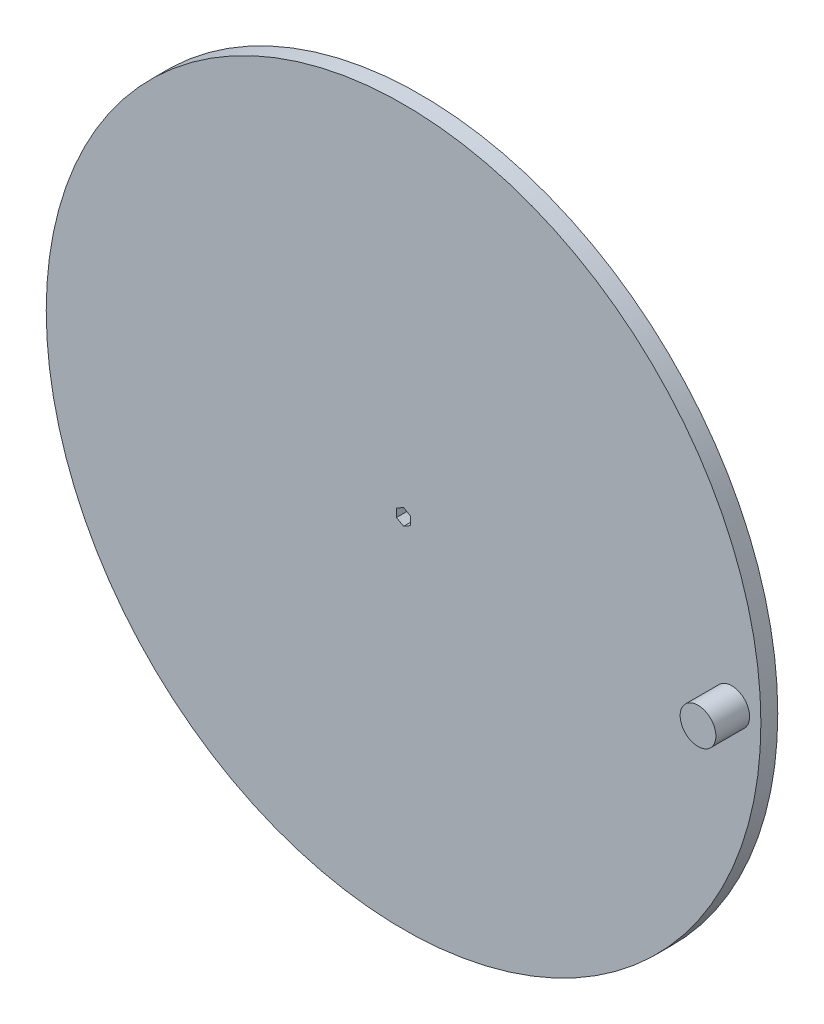
ISO-10303-21;
HEADER;
FILE_DESCRIPTION(('STEP AP214'),'2;1');
FILE_NAME('part.step','',(''),(''),'','','');
FILE_SCHEMA(('AUTOMOTIVE_DESIGN { 1 0 10303 214 1 1 1 1 }'));
ENDSEC;
DATA;
#1=APPLICATION_CONTEXT('core data for automotive mechanical design processes');
#2=APPLICATION_PROTOCOL_DEFINITION('international standard','automotive_design',2000,#1);
#3=PRODUCT_CONTEXT('',#1,'mechanical');
#4=PRODUCT('Part','Part','',(#3));
#5=PRODUCT_RELATED_PRODUCT_CATEGORY('part','',(#4));
#6=PRODUCT_DEFINITION_FORMATION('','',#4);
#7=PRODUCT_DEFINITION_CONTEXT('part definition',#1,'design');
#8=PRODUCT_DEFINITION('design','',#6,#7);
#9=PRODUCT_DEFINITION_SHAPE('','',#8);
#10=(LENGTH_UNIT() NAMED_UNIT(*) SI_UNIT(.MILLI.,.METRE.));
#11=(NAMED_UNIT(*) PLANE_ANGLE_UNIT() SI_UNIT($,.RADIAN.));
#12=(NAMED_UNIT(*) SI_UNIT($,.STERADIAN.) SOLID_ANGLE_UNIT());
#13=UNCERTAINTY_MEASURE_WITH_UNIT(LENGTH_MEASURE(1.E-05),#10,'distance_accuracy_value','');
#14=(GEOMETRIC_REPRESENTATION_CONTEXT(3) GLOBAL_UNCERTAINTY_ASSIGNED_CONTEXT((#13)) GLOBAL_UNIT_ASSIGNED_CONTEXT((#10,
#11,#12)) REPRESENTATION_CONTEXT('',''));
#15=CARTESIAN_POINT('',(0.,0.,0.));
#16=DIRECTION('',(0.,0.,1.));
#17=DIRECTION('',(1.,0.,0.));
#18=AXIS2_PLACEMENT_3D('',#15,#16,#17);
#19=CARTESIAN_POINT('',(0.,0.,0.));
#20=DIRECTION('',(0.,0.,1.));
#21=DIRECTION('',(1.,0.,0.));
#22=AXIS2_PLACEMENT_3D('',#19,#20,#21);
#23=PLANE('',#22);
#24=CARTESIAN_POINT('',(0.,0.,0.));
#25=DIRECTION('',(0.,0.,1.));
#26=DIRECTION('',(1.,0.,0.));
#27=AXIS2_PLACEMENT_3D('',#24,#25,#26);
#28=CIRCLE('',#27,11.8674969975976);
#29=CARTESIAN_POINT('',(11.8674969975976,0.,0.));
#30=VERTEX_POINT('',#29);
#31=EDGE_CURVE('E11',#30,#30,#28,.T.);
#32=ORIENTED_EDGE('',*,*,#31,.T.);
#33=EDGE_LOOP('',(#32));
#34=FACE_BOUND('',#33,.T.);
#35=CARTESIAN_POINT('',(0.,0.,0.));
#36=DIRECTION('',(0.,0.,1.));
#37=DIRECTION('',(1.,0.,0.));
#38=AXIS2_PLACEMENT_3D('',#35,#36,#37);
#39=CIRCLE('',#38,63.5);
#40=CARTESIAN_POINT('',(63.5,0.,0.));
#41=VERTEX_POINT('',#40);
#42=EDGE_CURVE('E147',#41,#41,#39,.T.);
#43=ORIENTED_EDGE('',*,*,#42,.F.);
#44=EDGE_LOOP('',(#43));
#45=FACE_BOUND('',#44,.T.);
#46=ADVANCED_FACE('F34',(#34,#45),#23,.F.);
#47=CARTESIAN_POINT('',(0.,0.,3.));
#48=DIRECTION('',(0.,0.,-1.));
#49=DIRECTION('',(-1.,0.,0.));
#50=AXIS2_PLACEMENT_3D('',#47,#48,#49);
#51=CYLINDRICAL_SURFACE('',#50,63.5);
#52=CARTESIAN_POINT('',(0.,0.,3.));
#53=DIRECTION('',(0.,0.,1.));
#54=DIRECTION('',(1.,0.,0.));
#55=AXIS2_PLACEMENT_3D('',#52,#53,#54);
#56=CIRCLE('',#55,63.5);
#57=CARTESIAN_POINT('',(63.5,0.,3.));
#58=VERTEX_POINT('',#57);
#59=EDGE_CURVE('E42',#58,#58,#56,.T.);
#60=ORIENTED_EDGE('',*,*,#59,.F.);
#61=EDGE_LOOP('',(#60));
#62=FACE_BOUND('',#61,.T.);
#63=ORIENTED_EDGE('',*,*,#42,.T.);
#64=EDGE_LOOP('',(#63));
#65=FACE_BOUND('',#64,.T.);
#66=ADVANCED_FACE('F154',(#62,#65),#51,.T.);
#67=CARTESIAN_POINT('',(0.,0.,3.));
#68=DIRECTION('',(0.,0.,1.));
#69=DIRECTION('',(1.,0.,0.));
#70=AXIS2_PLACEMENT_3D('',#67,#68,#69);
#71=PLANE('',#70);
#72=DIRECTION('',(-0.866025403784439,0.5,0.));
#73=VECTOR('',#72,1.);
#74=CARTESIAN_POINT('',(1.25,0.721687836487033,3.));
#75=LINE('',#74,#73);
#76=CARTESIAN_POINT('',(1.25,0.721687836487033,3.));
#77=VERTEX_POINT('',#76);
#78=CARTESIAN_POINT('',(0.,1.44337567297406,3.));
#79=VERTEX_POINT('',#78);
#80=EDGE_CURVE('E49',#77,#79,#75,.T.);
#81=ORIENTED_EDGE('',*,*,#80,.F.);
#82=DIRECTION('',(0.,1.,0.));
#83=VECTOR('',#82,1.);
#84=CARTESIAN_POINT('',(1.25,-0.721687836487032,3.));
#85=LINE('',#84,#83);
#86=CARTESIAN_POINT('',(1.25,-0.721687836487032,3.));
#87=VERTEX_POINT('',#86);
#88=EDGE_CURVE('E133',#87,#77,#85,.T.);
#89=ORIENTED_EDGE('',*,*,#88,.F.);
#90=DIRECTION('',(0.866025403784439,0.5,0.));
#91=VECTOR('',#90,1.);
#92=CARTESIAN_POINT('',(0.,-1.44337567297406,3.));
#93=LINE('',#92,#91);
#94=CARTESIAN_POINT('',(0.,-1.44337567297406,3.));
#95=VERTEX_POINT('',#94);
#96=EDGE_CURVE('E93',#95,#87,#93,.T.);
#97=ORIENTED_EDGE('',*,*,#96,.F.);
#98=DIRECTION('',(0.866025403784439,-0.5,0.));
#99=VECTOR('',#98,1.);
#100=CARTESIAN_POINT('',(-1.25,-0.721687836487032,3.));
#101=LINE('',#100,#99);
#102=CARTESIAN_POINT('',(-1.25,-0.721687836487032,3.));
#103=VERTEX_POINT('',#102);
#104=EDGE_CURVE('E129',#103,#95,#101,.T.);
#105=ORIENTED_EDGE('',*,*,#104,.F.);
#106=DIRECTION('',(0.,-1.,0.));
#107=VECTOR('',#106,1.);
#108=CARTESIAN_POINT('',(-1.25,0.721687836487033,3.));
#109=LINE('',#108,#107);
#110=CARTESIAN_POINT('',(-1.25,0.721687836487033,3.));
#111=VERTEX_POINT('',#110);
#112=EDGE_CURVE('E126',#111,#103,#109,.T.);
#113=ORIENTED_EDGE('',*,*,#112,.F.);
#114=DIRECTION('',(-0.866025403784439,-0.5,0.));
#115=VECTOR('',#114,1.);
#116=CARTESIAN_POINT('',(0.,1.44337567297406,3.));
#117=LINE('',#116,#115);
#118=EDGE_CURVE('E123',#79,#111,#117,.T.);
#119=ORIENTED_EDGE('',*,*,#118,.F.);
#120=EDGE_LOOP('',(#81,#89,#97,#105,#113,#119));
#121=FACE_BOUND('',#120,.T.);
#122=CARTESIAN_POINT('',(58.325,0.,3.));
#123=DIRECTION('',(0.,0.,1.));
#124=DIRECTION('',(1.,0.,0.));
#125=AXIS2_PLACEMENT_3D('',#122,#123,#124);
#126=CIRCLE('',#125,3.175);
#127=CARTESIAN_POINT('',(61.5,0.,3.));
#128=VERTEX_POINT('',#127);
#129=EDGE_CURVE('E136',#128,#128,#126,.T.);
#130=ORIENTED_EDGE('',*,*,#129,.F.);
#131=EDGE_LOOP('',(#130));
#132=FACE_BOUND('',#131,.T.);
#133=ORIENTED_EDGE('',*,*,#59,.T.);
#134=EDGE_LOOP('',(#133));
#135=FACE_BOUND('',#134,.T.);
#136=ADVANCED_FACE('F162',(#121,#132,#135),#71,.T.);
#137=CARTESIAN_POINT('',(58.325,0.,9.));
#138=DIRECTION('',(0.,0.,-1.));
#139=DIRECTION('',(-1.,0.,0.));
#140=AXIS2_PLACEMENT_3D('',#137,#138,#139);
#141=CYLINDRICAL_SURFACE('',#140,3.175);
#142=CARTESIAN_POINT('',(58.325,0.,9.));
#143=DIRECTION('',(0.,0.,1.));
#144=DIRECTION('',(1.,0.,0.));
#145=AXIS2_PLACEMENT_3D('',#142,#143,#144);
#146=CIRCLE('',#145,3.175);
#147=CARTESIAN_POINT('',(61.5,0.,9.));
#148=VERTEX_POINT('',#147);
#149=EDGE_CURVE('E144',#148,#148,#146,.T.);
#150=ORIENTED_EDGE('',*,*,#149,.F.);
#151=EDGE_LOOP('',(#150));
#152=FACE_BOUND('',#151,.T.);
#153=ORIENTED_EDGE('',*,*,#129,.T.);
#154=EDGE_LOOP('',(#153));
#155=FACE_BOUND('',#154,.T.);
#156=ADVANCED_FACE('F167',(#152,#155),#141,.T.);
#157=CARTESIAN_POINT('',(58.325,0.,9.));
#158=DIRECTION('',(0.,0.,1.));
#159=DIRECTION('',(1.,0.,0.));
#160=AXIS2_PLACEMENT_3D('',#157,#158,#159);
#161=PLANE('',#160);
#162=ORIENTED_EDGE('',*,*,#149,.T.);
#163=EDGE_LOOP('',(#162));
#164=FACE_BOUND('',#163,.T.);
#165=ADVANCED_FACE('F171',(#164),#161,.T.);
#166=CARTESIAN_POINT('',(1.25,0.721687836487033,-3.));
#167=DIRECTION('',(0.5,0.866025403784439,0.));
#168=DIRECTION('',(-0.866025403784439,0.5,0.));
#169=AXIS2_PLACEMENT_3D('',#166,#167,#168);
#170=PLANE('',#169);
#171=DIRECTION('',(0.,0.,1.));
#172=VECTOR('',#171,1.);
#173=CARTESIAN_POINT('',(1.25,0.721687836487033,-3.));
#174=LINE('',#173,#172);
#175=CARTESIAN_POINT('',(1.25,0.721687836487033,-6.5));
#176=VERTEX_POINT('',#175);
#177=EDGE_CURVE('E54',#176,#77,#174,.T.);
#178=ORIENTED_EDGE('',*,*,#177,.T.);
#179=ORIENTED_EDGE('',*,*,#80,.T.);
#180=DIRECTION('',(0.,0.,1.));
#181=VECTOR('',#180,1.);
#182=CARTESIAN_POINT('',(0.,1.44337567297406,-3.));
#183=LINE('',#182,#181);
#184=CARTESIAN_POINT('',(0.,1.44337567297406,-6.5));
#185=VERTEX_POINT('',#184);
#186=EDGE_CURVE('E135',#185,#79,#183,.T.);
#187=ORIENTED_EDGE('',*,*,#186,.F.);
#188=DIRECTION('',(0.866025403784439,-0.5,0.));
#189=VECTOR('',#188,1.);
#190=CARTESIAN_POINT('',(1.25,0.721687836487033,-6.5));
#191=LINE('',#190,#189);
#192=EDGE_CURVE('E117',#185,#176,#191,.T.);
#193=ORIENTED_EDGE('',*,*,#192,.T.);
#194=EDGE_LOOP('',(#178,#179,#187,#193));
#195=FACE_BOUND('',#194,.T.);
#196=ADVANCED_FACE('F175',(#195),#170,.F.);
#197=CARTESIAN_POINT('',(1.25,-0.721687836487032,-3.));
#198=DIRECTION('',(1.,0.,0.));
#199=DIRECTION('',(0.,1.,0.));
#200=AXIS2_PLACEMENT_3D('',#197,#198,#199);
#201=PLANE('',#200);
#202=DIRECTION('',(0.,0.,1.));
#203=VECTOR('',#202,1.);
#204=CARTESIAN_POINT('',(1.25,-0.721687836487032,-3.));
#205=LINE('',#204,#203);
#206=CARTESIAN_POINT('',(1.25,-0.721687836487032,-6.5));
#207=VERTEX_POINT('',#206);
#208=EDGE_CURVE('E86',#207,#87,#205,.T.);
#209=ORIENTED_EDGE('',*,*,#208,.T.);
#210=ORIENTED_EDGE('',*,*,#88,.T.);
#211=ORIENTED_EDGE('',*,*,#177,.F.);
#212=DIRECTION('',(0.,-1.,0.));
#213=VECTOR('',#212,1.);
#214=CARTESIAN_POINT('',(1.25,-0.721687836487032,-6.5));
#215=LINE('',#214,#213);
#216=EDGE_CURVE('E99',#176,#207,#215,.T.);
#217=ORIENTED_EDGE('',*,*,#216,.T.);
#218=EDGE_LOOP('',(#209,#210,#211,#217));
#219=FACE_BOUND('',#218,.T.);
#220=ADVANCED_FACE('F100',(#219),#201,.F.);
#221=CARTESIAN_POINT('',(0.,-1.44337567297406,-3.));
#222=DIRECTION('',(0.5,-0.866025403784439,0.));
#223=DIRECTION('',(0.866025403784439,0.5,0.));
#224=AXIS2_PLACEMENT_3D('',#221,#222,#223);
#225=PLANE('',#224);
#226=DIRECTION('',(0.,0.,1.));
#227=VECTOR('',#226,1.);
#228=CARTESIAN_POINT('',(0.,-1.44337567297406,-3.));
#229=LINE('',#228,#227);
#230=CARTESIAN_POINT('',(0.,-1.44337567297406,-6.5));
#231=VERTEX_POINT('',#230);
#232=EDGE_CURVE('E96',#231,#95,#229,.T.);
#233=ORIENTED_EDGE('',*,*,#232,.T.);
#234=ORIENTED_EDGE('',*,*,#96,.T.);
#235=ORIENTED_EDGE('',*,*,#208,.F.);
#236=DIRECTION('',(-0.866025403784439,-0.5,0.));
#237=VECTOR('',#236,1.);
#238=CARTESIAN_POINT('',(0.,-1.44337567297406,-6.5));
#239=LINE('',#238,#237);
#240=EDGE_CURVE('E90',#207,#231,#239,.T.);
#241=ORIENTED_EDGE('',*,*,#240,.T.);
#242=EDGE_LOOP('',(#233,#234,#235,#241));
#243=FACE_BOUND('',#242,.T.);
#244=ADVANCED_FACE('F88',(#243),#225,.F.);
#245=CARTESIAN_POINT('',(-1.25,-0.721687836487032,-3.));
#246=DIRECTION('',(-0.5,-0.866025403784438,0.));
#247=DIRECTION('',(0.866025403784439,-0.5,0.));
#248=AXIS2_PLACEMENT_3D('',#245,#246,#247);
#249=PLANE('',#248);
#250=DIRECTION('',(0.,0.,1.));
#251=VECTOR('',#250,1.);
#252=CARTESIAN_POINT('',(-1.25,-0.721687836487032,-3.));
#253=LINE('',#252,#251);
#254=CARTESIAN_POINT('',(-1.25,-0.721687836487032,-6.5));
#255=VERTEX_POINT('',#254);
#256=EDGE_CURVE('E139',#255,#103,#253,.T.);
#257=ORIENTED_EDGE('',*,*,#256,.T.);
#258=ORIENTED_EDGE('',*,*,#104,.T.);
#259=ORIENTED_EDGE('',*,*,#232,.F.);
#260=DIRECTION('',(-0.866025403784439,0.5,0.));
#261=VECTOR('',#260,1.);
#262=CARTESIAN_POINT('',(-1.25,-0.721687836487032,-6.5));
#263=LINE('',#262,#261);
#264=EDGE_CURVE('E107',#231,#255,#263,.T.);
#265=ORIENTED_EDGE('',*,*,#264,.T.);
#266=EDGE_LOOP('',(#257,#258,#259,#265));
#267=FACE_BOUND('',#266,.T.);
#268=ADVANCED_FACE('F186',(#267),#249,.F.);
#269=CARTESIAN_POINT('',(-1.25,0.721687836487033,-3.));
#270=DIRECTION('',(-1.,0.,0.));
#271=DIRECTION('',(0.,-1.,0.));
#272=AXIS2_PLACEMENT_3D('',#269,#270,#271);
#273=PLANE('',#272);
#274=DIRECTION('',(0.,0.,1.));
#275=VECTOR('',#274,1.);
#276=CARTESIAN_POINT('',(-1.25,0.721687836487033,-3.));
#277=LINE('',#276,#275);
#278=CARTESIAN_POINT('',(-1.25,0.721687836487033,-6.5));
#279=VERTEX_POINT('',#278);
#280=EDGE_CURVE('E141',#279,#111,#277,.T.);
#281=ORIENTED_EDGE('',*,*,#280,.T.);
#282=ORIENTED_EDGE('',*,*,#112,.T.);
#283=ORIENTED_EDGE('',*,*,#256,.F.);
#284=DIRECTION('',(0.,1.,0.));
#285=VECTOR('',#284,1.);
#286=CARTESIAN_POINT('',(-1.25,0.721687836487033,-6.5));
#287=LINE('',#286,#285);
#288=EDGE_CURVE('E109',#255,#279,#287,.T.);
#289=ORIENTED_EDGE('',*,*,#288,.T.);
#290=EDGE_LOOP('',(#281,#282,#283,#289));
#291=FACE_BOUND('',#290,.T.);
#292=ADVANCED_FACE('F182',(#291),#273,.F.);
#293=CARTESIAN_POINT('',(0.,1.44337567297406,-3.));
#294=DIRECTION('',(-0.5,0.866025403784439,0.));
#295=DIRECTION('',(-0.866025403784439,-0.5,0.));
#296=AXIS2_PLACEMENT_3D('',#293,#294,#295);
#297=PLANE('',#296);
#298=ORIENTED_EDGE('',*,*,#186,.T.);
#299=ORIENTED_EDGE('',*,*,#118,.T.);
#300=ORIENTED_EDGE('',*,*,#280,.F.);
#301=DIRECTION('',(0.866025403784439,0.5,0.));
#302=VECTOR('',#301,1.);
#303=CARTESIAN_POINT('',(0.,1.44337567297406,-6.5));
#304=LINE('',#303,#302);
#305=EDGE_CURVE('E114',#279,#185,#304,.T.);
#306=ORIENTED_EDGE('',*,*,#305,.T.);
#307=EDGE_LOOP('',(#298,#299,#300,#306));
#308=FACE_BOUND('',#307,.T.);
#309=ADVANCED_FACE('F179',(#308),#297,.F.);
#310=CARTESIAN_POINT('',(0.,0.,-6.5));
#311=DIRECTION('',(0.,0.,-1.));
#312=DIRECTION('',(-1.,0.,0.));
#313=AXIS2_PLACEMENT_3D('',#310,#311,#312);
#314=PLANE('',#313);
#315=CARTESIAN_POINT('',(0.,0.,-6.5));
#316=DIRECTION('',(0.,0.,-1.));
#317=DIRECTION('',(-1.,0.,0.));
#318=AXIS2_PLACEMENT_3D('',#315,#316,#317);
#319=CIRCLE('',#318,2.5);
#320=CARTESIAN_POINT('',(-2.5,0.,-6.5));
#321=VERTEX_POINT('',#320);
#322=EDGE_CURVE('E119',#321,#321,#319,.T.);
#323=ORIENTED_EDGE('',*,*,#322,.T.);
#324=EDGE_LOOP('',(#323));
#325=FACE_BOUND('',#324,.T.);
#326=ORIENTED_EDGE('',*,*,#240,.F.);
#327=ORIENTED_EDGE('',*,*,#216,.F.);
#328=ORIENTED_EDGE('',*,*,#192,.F.);
#329=ORIENTED_EDGE('',*,*,#305,.F.);
#330=ORIENTED_EDGE('',*,*,#288,.F.);
#331=ORIENTED_EDGE('',*,*,#264,.F.);
#332=EDGE_LOOP('',(#326,#327,#328,#329,#330,#331));
#333=FACE_BOUND('',#332,.T.);
#334=ADVANCED_FACE('F104',(#325,#333),#314,.T.);
#335=CARTESIAN_POINT('',(0.,0.,-10.));
#336=DIRECTION('',(0.,0.,1.));
#337=DIRECTION('',(1.,0.,0.));
#338=AXIS2_PLACEMENT_3D('',#335,#336,#337);
#339=TOROIDAL_SURFACE('',#338,11.8674969975976,10.);
#340=ORIENTED_EDGE('',*,*,#31,.F.);
#341=EDGE_LOOP('',(#340));
#342=FACE_BOUND('',#341,.T.);
#343=ORIENTED_EDGE('',*,*,#322,.F.);
#344=EDGE_LOOP('',(#343));
#345=FACE_BOUND('',#344,.T.);
#346=ADVANCED_FACE('F36',(#342,#345),#339,.F.);
#347=CLOSED_SHELL('',(#46,#66,#136,#156,#165,#196,#220,#244,#268,#292,#309,#334,#346));
#348=MANIFOLD_SOLID_BREP('B2',#347);
#349=ADVANCED_BREP_SHAPE_REPRESENTATION('',(#18,#348),#14);
#350=SHAPE_DEFINITION_REPRESENTATION(#9,#349);
ENDSEC;
END-ISO-10303-21;
